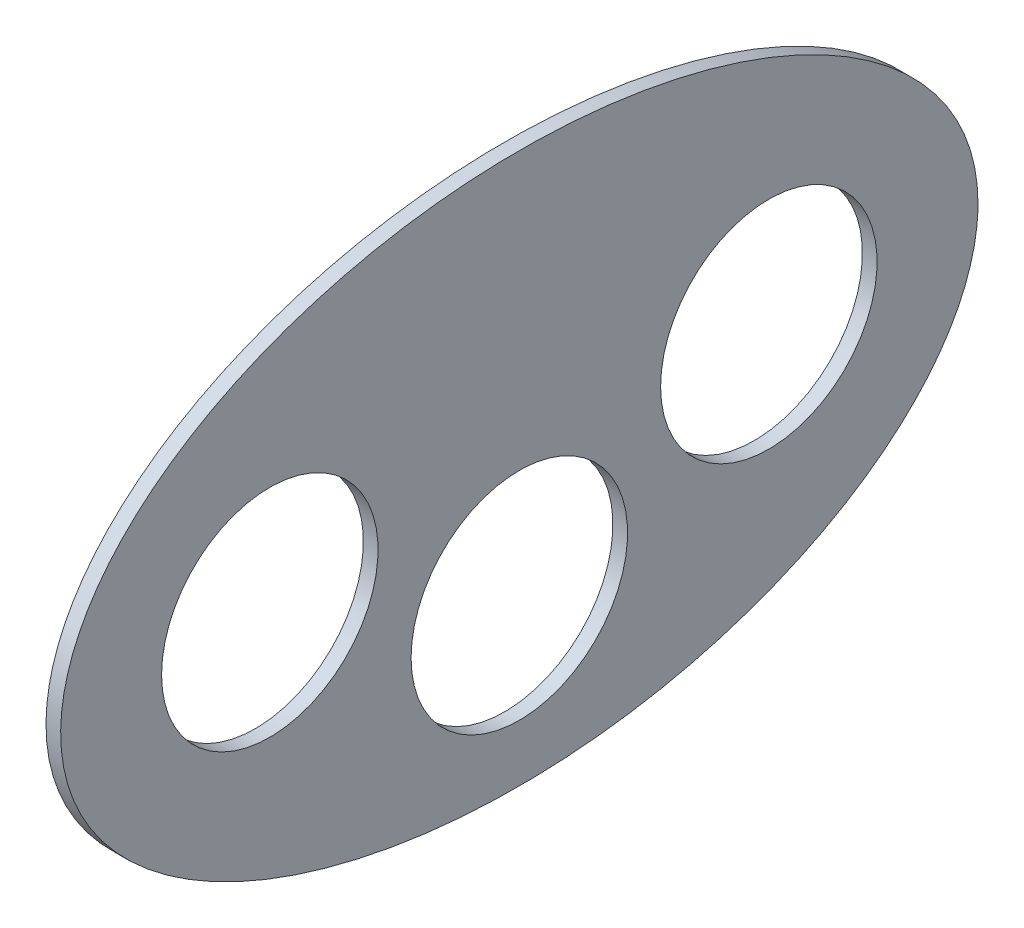
ISO-10303-21;
HEADER;
FILE_DESCRIPTION(('STEP AP214'),'2;1');
FILE_NAME('part.step','',(''),(''),'','','');
FILE_SCHEMA(('AUTOMOTIVE_DESIGN { 1 0 10303 214 1 1 1 1 }'));
ENDSEC;
DATA;
#1=APPLICATION_CONTEXT('core data for automotive mechanical design processes');
#2=APPLICATION_PROTOCOL_DEFINITION('international standard','automotive_design',2000,#1);
#3=PRODUCT_CONTEXT('',#1,'mechanical');
#4=PRODUCT('Part','Part','',(#3));
#5=PRODUCT_RELATED_PRODUCT_CATEGORY('part','',(#4));
#6=PRODUCT_DEFINITION_FORMATION('','',#4);
#7=PRODUCT_DEFINITION_CONTEXT('part definition',#1,'design');
#8=PRODUCT_DEFINITION('design','',#6,#7);
#9=PRODUCT_DEFINITION_SHAPE('','',#8);
#10=(LENGTH_UNIT() NAMED_UNIT(*) SI_UNIT(.MILLI.,.METRE.));
#11=(NAMED_UNIT(*) PLANE_ANGLE_UNIT() SI_UNIT($,.RADIAN.));
#12=(NAMED_UNIT(*) SI_UNIT($,.STERADIAN.) SOLID_ANGLE_UNIT());
#13=UNCERTAINTY_MEASURE_WITH_UNIT(LENGTH_MEASURE(1.E-05),#10,'distance_accuracy_value','');
#14=(GEOMETRIC_REPRESENTATION_CONTEXT(3) GLOBAL_UNCERTAINTY_ASSIGNED_CONTEXT((#13)) GLOBAL_UNIT_ASSIGNED_CONTEXT((#10,
#11,#12)) REPRESENTATION_CONTEXT('',''));
#15=CARTESIAN_POINT('',(0.,0.,0.));
#16=DIRECTION('',(0.,0.,1.));
#17=DIRECTION('',(1.,0.,0.));
#18=AXIS2_PLACEMENT_3D('',#15,#16,#17);
#19=CARTESIAN_POINT('',(4.,0.,0.));
#20=DIRECTION('',(1.,0.,0.));
#21=DIRECTION('',(0.,0.,-1.));
#22=AXIS2_PLACEMENT_3D('',#19,#20,#21);
#23=ELLIPSE('',#22,125.,75.);
#24=DIRECTION('',(-1.,0.,0.));
#25=VECTOR('',#24,1.);
#26=SURFACE_OF_LINEAR_EXTRUSION('',#23,#25);
#27=CARTESIAN_POINT('',(4.,0.,-125.));
#28=VERTEX_POINT('',#27);
#29=EDGE_CURVE('E10',#28,#28,#23,.T.);
#30=ORIENTED_EDGE('',*,*,#29,.F.);
#31=EDGE_LOOP('',(#30));
#32=FACE_BOUND('',#31,.T.);
#33=CARTESIAN_POINT('',(0.,0.,0.));
#34=DIRECTION('',(1.,0.,0.));
#35=DIRECTION('',(0.,0.,-1.));
#36=AXIS2_PLACEMENT_3D('',#33,#34,#35);
#37=ELLIPSE('',#36,125.,75.);
#38=CARTESIAN_POINT('',(0.,0.,-125.));
#39=VERTEX_POINT('',#38);
#40=EDGE_CURVE('E35',#39,#39,#37,.T.);
#41=ORIENTED_EDGE('',*,*,#40,.T.);
#42=EDGE_LOOP('',(#41));
#43=FACE_BOUND('',#42,.T.);
#44=ADVANCED_FACE('F31',(#32,#43),#26,.F.);
#45=CARTESIAN_POINT('',(4.,0.,0.));
#46=DIRECTION('',(1.,0.,0.));
#47=DIRECTION('',(0.,0.,-1.));
#48=AXIS2_PLACEMENT_3D('',#45,#46,#47);
#49=PLANE('',#48);
#50=CARTESIAN_POINT('',(4.,0.,68.));
#51=DIRECTION('',(-1.,0.,0.));
#52=DIRECTION('',(0.,0.,1.));
#53=AXIS2_PLACEMENT_3D('',#50,#51,#52);
#54=CIRCLE('',#53,29.5);
#55=CARTESIAN_POINT('',(4.,0.,97.5));
#56=VERTEX_POINT('',#55);
#57=EDGE_CURVE('E41',#56,#56,#54,.T.);
#58=ORIENTED_EDGE('',*,*,#57,.T.);
#59=EDGE_LOOP('',(#58));
#60=FACE_BOUND('',#59,.T.);
#61=CARTESIAN_POINT('',(4.,0.,-68.));
#62=DIRECTION('',(-1.,0.,0.));
#63=DIRECTION('',(0.,0.,1.));
#64=AXIS2_PLACEMENT_3D('',#61,#62,#63);
#65=CIRCLE('',#64,29.5);
#66=CARTESIAN_POINT('',(4.,0.,-38.5));
#67=VERTEX_POINT('',#66);
#68=EDGE_CURVE('E53',#67,#67,#65,.T.);
#69=ORIENTED_EDGE('',*,*,#68,.T.);
#70=EDGE_LOOP('',(#69));
#71=FACE_BOUND('',#70,.T.);
#72=CARTESIAN_POINT('',(4.,-30.,0.));
#73=DIRECTION('',(-1.,0.,0.));
#74=DIRECTION('',(0.,0.,1.));
#75=AXIS2_PLACEMENT_3D('',#72,#73,#74);
#76=CIRCLE('',#75,29.5);
#77=CARTESIAN_POINT('',(4.,-30.,29.5));
#78=VERTEX_POINT('',#77);
#79=EDGE_CURVE('E47',#78,#78,#76,.T.);
#80=ORIENTED_EDGE('',*,*,#79,.T.);
#81=EDGE_LOOP('',(#80));
#82=FACE_BOUND('',#81,.T.);
#83=ORIENTED_EDGE('',*,*,#29,.T.);
#84=EDGE_LOOP('',(#83));
#85=FACE_BOUND('',#84,.T.);
#86=ADVANCED_FACE('F62',(#60,#71,#82,#85),#49,.T.);
#87=CARTESIAN_POINT('',(0.,0.,0.));
#88=DIRECTION('',(1.,0.,0.));
#89=DIRECTION('',(0.,0.,-1.));
#90=AXIS2_PLACEMENT_3D('',#87,#88,#89);
#91=PLANE('',#90);
#92=CARTESIAN_POINT('',(0.,0.,68.));
#93=DIRECTION('',(-1.,0.,0.));
#94=DIRECTION('',(0.,0.,1.));
#95=AXIS2_PLACEMENT_3D('',#92,#93,#94);
#96=CIRCLE('',#95,29.5);
#97=CARTESIAN_POINT('',(0.,0.,97.5));
#98=VERTEX_POINT('',#97);
#99=EDGE_CURVE('E56',#98,#98,#96,.T.);
#100=ORIENTED_EDGE('',*,*,#99,.F.);
#101=EDGE_LOOP('',(#100));
#102=FACE_BOUND('',#101,.T.);
#103=CARTESIAN_POINT('',(0.,0.,-68.));
#104=DIRECTION('',(-1.,0.,0.));
#105=DIRECTION('',(0.,0.,1.));
#106=AXIS2_PLACEMENT_3D('',#103,#104,#105);
#107=CIRCLE('',#106,29.5);
#108=CARTESIAN_POINT('',(0.,0.,-38.5));
#109=VERTEX_POINT('',#108);
#110=EDGE_CURVE('E50',#109,#109,#107,.T.);
#111=ORIENTED_EDGE('',*,*,#110,.F.);
#112=EDGE_LOOP('',(#111));
#113=FACE_BOUND('',#112,.T.);
#114=CARTESIAN_POINT('',(0.,-30.,0.));
#115=DIRECTION('',(-1.,0.,0.));
#116=DIRECTION('',(0.,0.,1.));
#117=AXIS2_PLACEMENT_3D('',#114,#115,#116);
#118=CIRCLE('',#117,29.5);
#119=CARTESIAN_POINT('',(0.,-30.,29.5));
#120=VERTEX_POINT('',#119);
#121=EDGE_CURVE('E44',#120,#120,#118,.T.);
#122=ORIENTED_EDGE('',*,*,#121,.F.);
#123=EDGE_LOOP('',(#122));
#124=FACE_BOUND('',#123,.T.);
#125=ORIENTED_EDGE('',*,*,#40,.F.);
#126=EDGE_LOOP('',(#125));
#127=FACE_BOUND('',#126,.T.);
#128=ADVANCED_FACE('F72',(#102,#113,#124,#127),#91,.F.);
#129=CARTESIAN_POINT('',(4.,-30.,0.));
#130=DIRECTION('',(-1.,0.,0.));
#131=DIRECTION('',(0.,0.,1.));
#132=AXIS2_PLACEMENT_3D('',#129,#130,#131);
#133=CYLINDRICAL_SURFACE('',#132,29.5);
#134=ORIENTED_EDGE('',*,*,#79,.F.);
#135=EDGE_LOOP('',(#134));
#136=FACE_BOUND('',#135,.T.);
#137=ORIENTED_EDGE('',*,*,#121,.T.);
#138=EDGE_LOOP('',(#137));
#139=FACE_BOUND('',#138,.T.);
#140=ADVANCED_FACE('F75',(#136,#139),#133,.F.);
#141=CARTESIAN_POINT('',(4.,0.,-68.));
#142=DIRECTION('',(-1.,0.,0.));
#143=DIRECTION('',(0.,0.,1.));
#144=AXIS2_PLACEMENT_3D('',#141,#142,#143);
#145=CYLINDRICAL_SURFACE('',#144,29.5);
#146=ORIENTED_EDGE('',*,*,#68,.F.);
#147=EDGE_LOOP('',(#146));
#148=FACE_BOUND('',#147,.T.);
#149=ORIENTED_EDGE('',*,*,#110,.T.);
#150=EDGE_LOOP('',(#149));
#151=FACE_BOUND('',#150,.T.);
#152=ADVANCED_FACE('F68',(#148,#151),#145,.F.);
#153=CARTESIAN_POINT('',(4.,0.,68.));
#154=DIRECTION('',(-1.,0.,0.));
#155=DIRECTION('',(0.,0.,1.));
#156=AXIS2_PLACEMENT_3D('',#153,#154,#155);
#157=CYLINDRICAL_SURFACE('',#156,29.5);
#158=ORIENTED_EDGE('',*,*,#57,.F.);
#159=EDGE_LOOP('',(#158));
#160=FACE_BOUND('',#159,.T.);
#161=ORIENTED_EDGE('',*,*,#99,.T.);
#162=EDGE_LOOP('',(#161));
#163=FACE_BOUND('',#162,.T.);
#164=ADVANCED_FACE('F65',(#160,#163),#157,.F.);
#165=CLOSED_SHELL('',(#44,#86,#128,#140,#152,#164));
#166=MANIFOLD_SOLID_BREP('B2',#165);
#167=ADVANCED_BREP_SHAPE_REPRESENTATION('',(#18,#166),#14);
#168=SHAPE_DEFINITION_REPRESENTATION(#9,#167);
ENDSEC;
END-ISO-10303-21;
